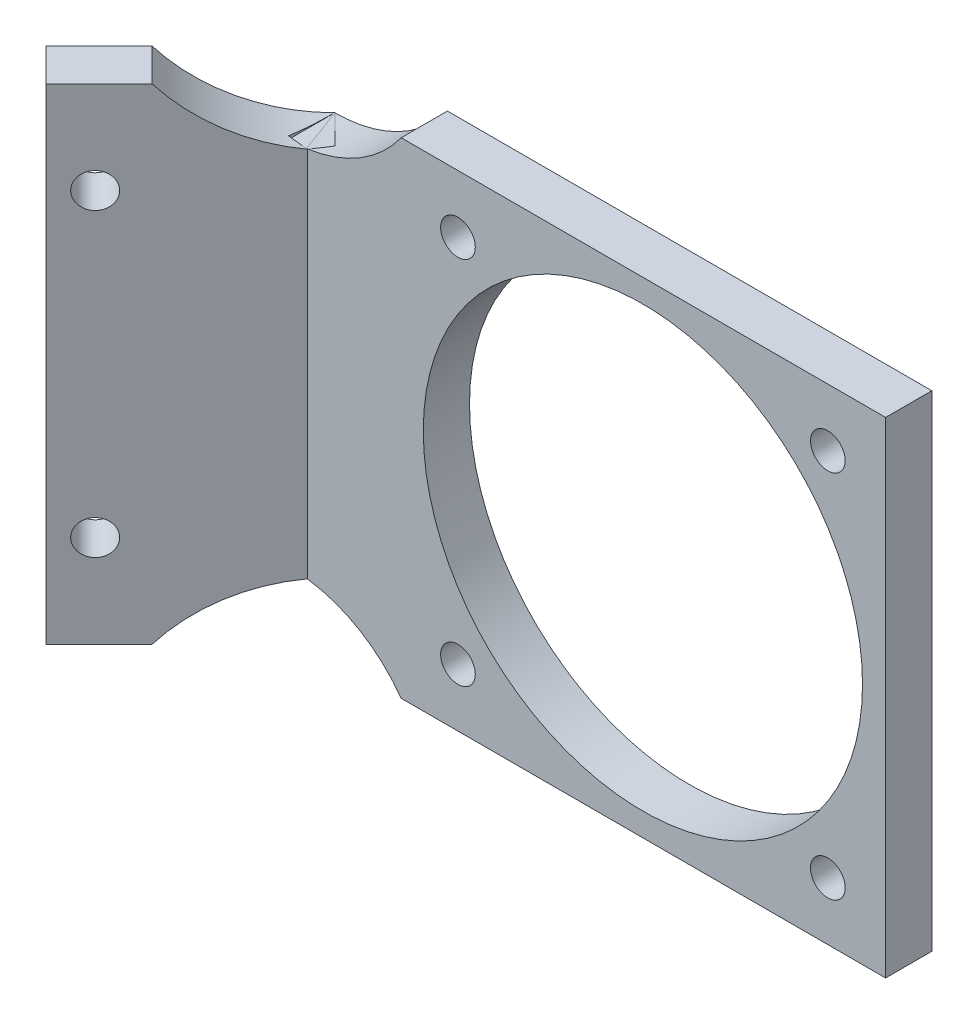
ISO-10303-21;
HEADER;
FILE_DESCRIPTION(('STEP AP214'),'2;1');
FILE_NAME('part.step','',(''),(''),'','','');
FILE_SCHEMA(('AUTOMOTIVE_DESIGN { 1 0 10303 214 1 1 1 1 }'));
ENDSEC;
DATA;
#1=APPLICATION_CONTEXT('core data for automotive mechanical design processes');
#2=APPLICATION_PROTOCOL_DEFINITION('international standard','automotive_design',2000,#1);
#3=PRODUCT_CONTEXT('',#1,'mechanical');
#4=PRODUCT('Part','Part','',(#3));
#5=PRODUCT_RELATED_PRODUCT_CATEGORY('part','',(#4));
#6=PRODUCT_DEFINITION_FORMATION('','',#4);
#7=PRODUCT_DEFINITION_CONTEXT('part definition',#1,'design');
#8=PRODUCT_DEFINITION('design','',#6,#7);
#9=PRODUCT_DEFINITION_SHAPE('','',#8);
#10=(LENGTH_UNIT() NAMED_UNIT(*) SI_UNIT(.MILLI.,.METRE.));
#11=(NAMED_UNIT(*) PLANE_ANGLE_UNIT() SI_UNIT($,.RADIAN.));
#12=(NAMED_UNIT(*) SI_UNIT($,.STERADIAN.) SOLID_ANGLE_UNIT());
#13=UNCERTAINTY_MEASURE_WITH_UNIT(LENGTH_MEASURE(1.E-05),#10,'distance_accuracy_value','');
#14=(GEOMETRIC_REPRESENTATION_CONTEXT(3) GLOBAL_UNCERTAINTY_ASSIGNED_CONTEXT((#13)) GLOBAL_UNIT_ASSIGNED_CONTEXT((#10,
#11,#12)) REPRESENTATION_CONTEXT('',''));
#15=CARTESIAN_POINT('',(0.,0.,0.));
#16=DIRECTION('',(0.,0.,1.));
#17=DIRECTION('',(1.,0.,0.));
#18=AXIS2_PLACEMENT_3D('',#15,#16,#17);
#19=CARTESIAN_POINT('',(0.,0.,0.));
#20=DIRECTION('',(0.,1.,0.));
#21=DIRECTION('',(0.,0.,1.));
#22=AXIS2_PLACEMENT_3D('',#19,#20,#21);
#23=PLANE('',#22);
#24=DIRECTION('',(-0.707106781186546,0.,0.707106781186549));
#25=VECTOR('',#24,1.);
#26=CARTESIAN_POINT('',(-12.4852813742386,0.,12.4852813742386));
#27=LINE('',#26,#25);
#28=CARTESIAN_POINT('',(-7.90569415042093,0.,7.90569415042097));
#29=VERTEX_POINT('',#28);
#30=CARTESIAN_POINT('',(-12.4852813742386,0.,12.4852813742386));
#31=VERTEX_POINT('',#30);
#32=EDGE_CURVE('E341',#29,#31,#27,.T.);
#33=ORIENTED_EDGE('',*,*,#32,.F.);
#34=DIRECTION('',(-0.707106781186549,0.,-0.707106781186546));
#35=VECTOR('',#34,1.);
#36=CARTESIAN_POINT('',(3.58298701216966,0.,19.3943753130115));
#37=LINE('',#36,#35);
#38=CARTESIAN_POINT('',(-5.07726702567474,0.,10.7341212751671));
#39=VERTEX_POINT('',#38);
#40=EDGE_CURVE('E343',#39,#29,#37,.T.);
#41=ORIENTED_EDGE('',*,*,#40,.F.);
#42=DIRECTION('',(0.707106781186546,0.,-0.707106781186549));
#43=VECTOR('',#42,1.);
#44=CARTESIAN_POINT('',(1.65685424949237,0.,4.00000000000001));
#45=LINE('',#44,#43);
#46=CARTESIAN_POINT('',(-9.65685424949237,0.,15.3137084989848));
#47=VERTEX_POINT('',#46);
#48=EDGE_CURVE('E350',#47,#39,#45,.T.);
#49=ORIENTED_EDGE('',*,*,#48,.F.);
#50=DIRECTION('',(0.707106781186549,0.,0.707106781186546));
#51=VECTOR('',#50,1.);
#52=CARTESIAN_POINT('',(-9.65685424949237,0.,15.3137084989848));
#53=LINE('',#52,#51);
#54=EDGE_CURVE('E345',#31,#47,#53,.T.);
#55=ORIENTED_EDGE('',*,*,#54,.F.);
#56=EDGE_LOOP('',(#33,#41,#49,#55));
#57=FACE_BOUND('',#56,.T.);
#58=ADVANCED_FACE('F35',(#57),#23,.F.);
#59=CARTESIAN_POINT('',(0.,42.,0.));
#60=DIRECTION('',(0.,1.,0.));
#61=DIRECTION('',(0.,0.,1.));
#62=AXIS2_PLACEMENT_3D('',#59,#60,#61);
#63=PLANE('',#62);
#64=DIRECTION('',(-0.707106781186549,0.,-0.707106781186546));
#65=VECTOR('',#64,1.);
#66=CARTESIAN_POINT('',(3.58298701216967,42.,19.3943753130115));
#67=LINE('',#66,#65);
#68=CARTESIAN_POINT('',(-5.07726702567474,42.,10.7341212751671));
#69=VERTEX_POINT('',#68);
#70=CARTESIAN_POINT('',(-7.90569415042093,42.,7.90569415042096));
#71=VERTEX_POINT('',#70);
#72=EDGE_CURVE('E408',#69,#71,#67,.T.);
#73=ORIENTED_EDGE('',*,*,#72,.T.);
#74=DIRECTION('',(-0.707106781186546,0.,0.707106781186549));
#75=VECTOR('',#74,1.);
#76=CARTESIAN_POINT('',(-12.4852813742386,42.,12.4852813742386));
#77=LINE('',#76,#75);
#78=CARTESIAN_POINT('',(-12.4852813742386,42.,12.4852813742386));
#79=VERTEX_POINT('',#78);
#80=EDGE_CURVE('E93',#71,#79,#77,.T.);
#81=ORIENTED_EDGE('',*,*,#80,.T.);
#82=DIRECTION('',(0.707106781186549,0.,0.707106781186546));
#83=VECTOR('',#82,1.);
#84=CARTESIAN_POINT('',(-9.65685424949237,42.,15.3137084989848));
#85=LINE('',#84,#83);
#86=CARTESIAN_POINT('',(-9.65685424949237,42.,15.3137084989848));
#87=VERTEX_POINT('',#86);
#88=EDGE_CURVE('E187',#79,#87,#85,.T.);
#89=ORIENTED_EDGE('',*,*,#88,.T.);
#90=DIRECTION('',(0.707106781186546,0.,-0.707106781186549));
#91=VECTOR('',#90,1.);
#92=CARTESIAN_POINT('',(1.65685424949237,42.,4.00000000000001));
#93=LINE('',#92,#91);
#94=EDGE_CURVE('E363',#87,#69,#93,.T.);
#95=ORIENTED_EDGE('',*,*,#94,.T.);
#96=EDGE_LOOP('',(#73,#81,#89,#95));
#97=FACE_BOUND('',#96,.T.);
#98=ADVANCED_FACE('F307',(#97),#63,.T.);
#99=CARTESIAN_POINT('',(-12.4852813742386,42.,12.4852813742386));
#100=DIRECTION('',(0.707106781186549,0.,0.707106781186546));
#101=DIRECTION('',(0.707106781186546,0.,-0.707106781186549));
#102=AXIS2_PLACEMENT_3D('',#99,#100,#101);
#103=PLANE('',#102);
#104=CARTESIAN_POINT('',(-10.3639610306789,8.,10.363961030679));
#105=DIRECTION('',(0.707106781186549,0.,0.707106781186546));
#106=DIRECTION('',(0.707106781186546,0.,-0.707106781186549));
#107=AXIS2_PLACEMENT_3D('',#104,#105,#106);
#108=CIRCLE('',#107,1.5);
#109=CARTESIAN_POINT('',(-9.3033008588991,8.,9.30330085889914));
#110=VERTEX_POINT('',#109);
#111=EDGE_CURVE('E371',#110,#110,#108,.F.);
#112=ORIENTED_EDGE('',*,*,#111,.F.);
#113=EDGE_LOOP('',(#112));
#114=FACE_BOUND('',#113,.T.);
#115=CARTESIAN_POINT('',(-10.3639610306789,34.,10.363961030679));
#116=DIRECTION('',(0.707106781186549,0.,0.707106781186546));
#117=DIRECTION('',(0.707106781186546,0.,-0.707106781186549));
#118=AXIS2_PLACEMENT_3D('',#115,#116,#117);
#119=CIRCLE('',#118,1.5);
#120=CARTESIAN_POINT('',(-9.3033008588991,34.,9.30330085889914));
#121=VERTEX_POINT('',#120);
#122=EDGE_CURVE('E348',#121,#121,#119,.F.);
#123=ORIENTED_EDGE('',*,*,#122,.F.);
#124=EDGE_LOOP('',(#123));
#125=FACE_BOUND('',#124,.T.);
#126=DIRECTION('',(0.,-1.,0.));
#127=VECTOR('',#126,1.);
#128=CARTESIAN_POINT('',(0.,42.,0.));
#129=LINE('',#128,#127);
#130=CARTESIAN_POINT('',(0.,37.,0.));
#131=VERTEX_POINT('',#130);
#132=CARTESIAN_POINT('',(0.,5.,0.));
#133=VERTEX_POINT('',#132);
#134=EDGE_CURVE('E192',#131,#133,#129,.T.);
#135=ORIENTED_EDGE('',*,*,#134,.T.);
#136=CARTESIAN_POINT('',(0.,-10.,0.));
#137=DIRECTION('',(-0.707106781186549,0.,-0.707106781186546));
#138=DIRECTION('',(0.707106781186546,0.,-0.707106781186549));
#139=AXIS2_PLACEMENT_3D('',#136,#137,#138);
#140=CIRCLE('',#139,15.);
#141=EDGE_CURVE('E220',#29,#133,#140,.T.);
#142=ORIENTED_EDGE('',*,*,#141,.F.);
#143=ORIENTED_EDGE('',*,*,#32,.T.);
#144=DIRECTION('',(0.,-1.,0.));
#145=VECTOR('',#144,1.);
#146=CARTESIAN_POINT('',(-12.4852813742386,42.,12.4852813742386));
#147=LINE('',#146,#145);
#148=EDGE_CURVE('E205',#79,#31,#147,.T.);
#149=ORIENTED_EDGE('',*,*,#148,.F.);
#150=ORIENTED_EDGE('',*,*,#80,.F.);
#151=CARTESIAN_POINT('',(0.,52.,0.));
#152=DIRECTION('',(-0.707106781186549,0.,-0.707106781186546));
#153=DIRECTION('',(-0.707106781186546,0.,0.707106781186549));
#154=AXIS2_PLACEMENT_3D('',#151,#152,#153);
#155=CIRCLE('',#154,15.);
#156=EDGE_CURVE('E411',#131,#71,#155,.T.);
#157=ORIENTED_EDGE('',*,*,#156,.F.);
#158=EDGE_LOOP('',(#135,#142,#143,#149,#150,#157));
#159=FACE_BOUND('',#158,.T.);
#160=ADVANCED_FACE('F37',(#114,#125,#159),#103,.F.);
#161=CARTESIAN_POINT('',(-9.65685424949237,42.,15.3137084989848));
#162=DIRECTION('',(0.707106781186546,0.,-0.707106781186549));
#163=DIRECTION('',(-0.707106781186549,0.,-0.707106781186546));
#164=AXIS2_PLACEMENT_3D('',#161,#162,#163);
#165=PLANE('',#164);
#166=ORIENTED_EDGE('',*,*,#54,.T.);
#167=DIRECTION('',(0.,-1.,0.));
#168=VECTOR('',#167,1.);
#169=CARTESIAN_POINT('',(-9.65685424949237,42.,15.3137084989848));
#170=LINE('',#169,#168);
#171=EDGE_CURVE('E202',#87,#47,#170,.T.);
#172=ORIENTED_EDGE('',*,*,#171,.F.);
#173=ORIENTED_EDGE('',*,*,#88,.F.);
#174=ORIENTED_EDGE('',*,*,#148,.T.);
#175=EDGE_LOOP('',(#166,#172,#173,#174));
#176=FACE_BOUND('',#175,.T.);
#177=ADVANCED_FACE('F322',(#176),#165,.F.);
#178=CARTESIAN_POINT('',(1.65685424949237,42.,4.00000000000001));
#179=DIRECTION('',(-0.707106781186549,0.,-0.707106781186546));
#180=DIRECTION('',(-0.707106781186546,0.,0.707106781186549));
#181=AXIS2_PLACEMENT_3D('',#178,#179,#180);
#182=PLANE('',#181);
#183=CARTESIAN_POINT('',(-7.53553390593273,8.,13.1923881554251));
#184=DIRECTION('',(0.707106781186549,0.,0.707106781186546));
#185=DIRECTION('',(0.707106781186546,0.,-0.707106781186549));
#186=AXIS2_PLACEMENT_3D('',#183,#184,#185);
#187=CIRCLE('',#186,1.5);
#188=CARTESIAN_POINT('',(-6.47487373415291,8.,12.1317279836453));
#189=VERTEX_POINT('',#188);
#190=EDGE_CURVE('E374',#189,#189,#187,.T.);
#191=ORIENTED_EDGE('',*,*,#190,.F.);
#192=EDGE_LOOP('',(#191));
#193=FACE_BOUND('',#192,.T.);
#194=CARTESIAN_POINT('',(-7.53553390593273,34.,13.1923881554251));
#195=DIRECTION('',(0.707106781186549,0.,0.707106781186546));
#196=DIRECTION('',(0.707106781186546,0.,-0.707106781186549));
#197=AXIS2_PLACEMENT_3D('',#194,#195,#196);
#198=CIRCLE('',#197,1.5);
#199=CARTESIAN_POINT('',(-6.47487373415291,34.,12.1317279836453));
#200=VERTEX_POINT('',#199);
#201=EDGE_CURVE('E353',#200,#200,#198,.T.);
#202=ORIENTED_EDGE('',*,*,#201,.F.);
#203=EDGE_LOOP('',(#202));
#204=FACE_BOUND('',#203,.T.);
#205=ORIENTED_EDGE('',*,*,#48,.T.);
#206=CARTESIAN_POINT('',(2.82842712474619,-10.,2.82842712474618));
#207=DIRECTION('',(-0.707106781186549,0.,-0.707106781186546));
#208=DIRECTION('',(-0.707106781186546,0.,0.707106781186549));
#209=AXIS2_PLACEMENT_3D('',#206,#207,#208);
#210=CIRCLE('',#209,15.);
#211=CARTESIAN_POINT('',(1.65685424949237,4.90821364201422,4.));
#212=VERTEX_POINT('',#211);
#213=EDGE_CURVE('E426',#212,#39,#210,.F.);
#214=ORIENTED_EDGE('',*,*,#213,.F.);
#215=DIRECTION('',(0.,-1.,0.));
#216=VECTOR('',#215,1.);
#217=CARTESIAN_POINT('',(1.65685424949237,42.,4.00000000000001));
#218=LINE('',#217,#216);
#219=CARTESIAN_POINT('',(1.65685424949237,37.0917863579858,4.));
#220=VERTEX_POINT('',#219);
#221=EDGE_CURVE('E199',#220,#212,#218,.T.);
#222=ORIENTED_EDGE('',*,*,#221,.F.);
#223=CARTESIAN_POINT('',(2.82842712474619,52.,2.82842712474618));
#224=DIRECTION('',(-0.707106781186549,0.,-0.707106781186546));
#225=DIRECTION('',(-0.707106781186546,0.,0.707106781186549));
#226=AXIS2_PLACEMENT_3D('',#223,#224,#225);
#227=CIRCLE('',#226,15.);
#228=EDGE_CURVE('E407',#69,#220,#227,.F.);
#229=ORIENTED_EDGE('',*,*,#228,.F.);
#230=ORIENTED_EDGE('',*,*,#94,.F.);
#231=ORIENTED_EDGE('',*,*,#171,.T.);
#232=EDGE_LOOP('',(#205,#214,#222,#229,#230,#231));
#233=FACE_BOUND('',#232,.T.);
#234=ADVANCED_FACE('F319',(#193,#204,#233),#182,.F.);
#235=CARTESIAN_POINT('',(51.6568542494924,42.,4.));
#236=DIRECTION('',(0.,0.,-1.));
#237=DIRECTION('',(-1.,0.,0.));
#238=AXIS2_PLACEMENT_3D('',#235,#236,#237);
#239=PLANE('',#238);
#240=CARTESIAN_POINT('',(30.6568542494924,21.,4.00000000000001));
#241=DIRECTION('',(0.,0.,1.));
#242=DIRECTION('',(1.,0.,0.));
#243=AXIS2_PLACEMENT_3D('',#240,#241,#242);
#244=CIRCLE('',#243,19.);
#245=CARTESIAN_POINT('',(49.6568542494924,21.,4.00000000000001));
#246=VERTEX_POINT('',#245);
#247=EDGE_CURVE('E404',#246,#246,#244,.T.);
#248=ORIENTED_EDGE('',*,*,#247,.F.);
#249=EDGE_LOOP('',(#248));
#250=FACE_BOUND('',#249,.T.);
#251=CARTESIAN_POINT('',(14.6568542494924,5.,4.00000000000001));
#252=DIRECTION('',(0.,0.,1.));
#253=DIRECTION('',(1.,0.,0.));
#254=AXIS2_PLACEMENT_3D('',#251,#252,#253);
#255=CIRCLE('',#254,1.5);
#256=CARTESIAN_POINT('',(16.1568542494924,5.,4.00000000000001));
#257=VERTEX_POINT('',#256);
#258=EDGE_CURVE('E398',#257,#257,#255,.T.);
#259=ORIENTED_EDGE('',*,*,#258,.F.);
#260=EDGE_LOOP('',(#259));
#261=FACE_BOUND('',#260,.T.);
#262=CARTESIAN_POINT('',(46.6568542494924,5.,4.00000000000001));
#263=DIRECTION('',(0.,0.,1.));
#264=DIRECTION('',(1.,0.,0.));
#265=AXIS2_PLACEMENT_3D('',#262,#263,#264);
#266=CIRCLE('',#265,1.5);
#267=CARTESIAN_POINT('',(48.1568542494924,5.,4.00000000000001));
#268=VERTEX_POINT('',#267);
#269=EDGE_CURVE('E392',#268,#268,#266,.T.);
#270=ORIENTED_EDGE('',*,*,#269,.F.);
#271=EDGE_LOOP('',(#270));
#272=FACE_BOUND('',#271,.T.);
#273=CARTESIAN_POINT('',(46.6568542494924,37.,4.00000000000001));
#274=DIRECTION('',(0.,0.,1.));
#275=DIRECTION('',(1.,0.,0.));
#276=AXIS2_PLACEMENT_3D('',#273,#274,#275);
#277=CIRCLE('',#276,1.5);
#278=CARTESIAN_POINT('',(48.1568542494924,37.,4.00000000000001));
#279=VERTEX_POINT('',#278);
#280=EDGE_CURVE('E386',#279,#279,#277,.T.);
#281=ORIENTED_EDGE('',*,*,#280,.F.);
#282=EDGE_LOOP('',(#281));
#283=FACE_BOUND('',#282,.T.);
#284=CARTESIAN_POINT('',(14.6568542494924,37.,4.00000000000001));
#285=DIRECTION('',(0.,0.,1.));
#286=DIRECTION('',(1.,0.,0.));
#287=AXIS2_PLACEMENT_3D('',#284,#285,#286);
#288=CIRCLE('',#287,1.5);
#289=CARTESIAN_POINT('',(16.1568542494924,37.,4.00000000000001));
#290=VERTEX_POINT('',#289);
#291=EDGE_CURVE('E380',#290,#290,#288,.T.);
#292=ORIENTED_EDGE('',*,*,#291,.F.);
#293=EDGE_LOOP('',(#292));
#294=FACE_BOUND('',#293,.T.);
#295=DIRECTION('',(0.,1.,0.));
#296=VECTOR('',#295,1.);
#297=CARTESIAN_POINT('',(1.65685424949238,42.,4.00000000000001));
#298=LINE('',#297,#296);
#299=CARTESIAN_POINT('',(1.65685424949237,4.8850676900024,4.00000000000001));
#300=VERTEX_POINT('',#299);
#301=EDGE_CURVE('E416',#300,#212,#298,.T.);
#302=ORIENTED_EDGE('',*,*,#301,.F.);
#303=CARTESIAN_POINT('',(0.,-7.,4.00000000000001));
#304=DIRECTION('',(0.,0.,-1.));
#305=DIRECTION('',(-1.,0.,0.));
#306=AXIS2_PLACEMENT_3D('',#303,#304,#305);
#307=CIRCLE('',#306,12.);
#308=CARTESIAN_POINT('',(9.74679434480896,0.,4.00000000000001));
#309=VERTEX_POINT('',#308);
#310=EDGE_CURVE('E235',#309,#300,#307,.F.);
#311=ORIENTED_EDGE('',*,*,#310,.F.);
#312=DIRECTION('',(1.,0.,0.));
#313=VECTOR('',#312,1.);
#314=CARTESIAN_POINT('',(51.6568542494924,0.,4.));
#315=LINE('',#314,#313);
#316=CARTESIAN_POINT('',(51.6568542494924,0.,4.));
#317=VERTEX_POINT('',#316);
#318=EDGE_CURVE('E180',#309,#317,#315,.T.);
#319=ORIENTED_EDGE('',*,*,#318,.T.);
#320=DIRECTION('',(0.,-1.,0.));
#321=VECTOR('',#320,1.);
#322=CARTESIAN_POINT('',(51.6568542494924,42.,4.));
#323=LINE('',#322,#321);
#324=CARTESIAN_POINT('',(51.6568542494924,42.,4.));
#325=VERTEX_POINT('',#324);
#326=EDGE_CURVE('E197',#325,#317,#323,.T.);
#327=ORIENTED_EDGE('',*,*,#326,.F.);
#328=DIRECTION('',(1.,0.,0.));
#329=VECTOR('',#328,1.);
#330=CARTESIAN_POINT('',(51.6568542494924,42.,4.));
#331=LINE('',#330,#329);
#332=CARTESIAN_POINT('',(9.74679434480896,42.,4.00000000000001));
#333=VERTEX_POINT('',#332);
#334=EDGE_CURVE('E362',#333,#325,#331,.T.);
#335=ORIENTED_EDGE('',*,*,#334,.F.);
#336=CARTESIAN_POINT('',(0.,49.,4.00000000000001));
#337=DIRECTION('',(0.,0.,-1.));
#338=DIRECTION('',(-1.,0.,0.));
#339=AXIS2_PLACEMENT_3D('',#336,#337,#338);
#340=CIRCLE('',#339,12.);
#341=CARTESIAN_POINT('',(1.65685424949237,37.1149323099976,4.00000000000001));
#342=VERTEX_POINT('',#341);
#343=EDGE_CURVE('E242',#342,#333,#340,.F.);
#344=ORIENTED_EDGE('',*,*,#343,.F.);
#345=EDGE_CURVE('E200',#342,#220,#218,.T.);
#346=ORIENTED_EDGE('',*,*,#345,.T.);
#347=ORIENTED_EDGE('',*,*,#221,.T.);
#348=EDGE_LOOP('',(#302,#311,#319,#327,#335,#344,#346,#347));
#349=FACE_BOUND('',#348,.T.);
#350=ADVANCED_FACE('F316',(#250,#261,#272,#283,#294,#349),#239,.F.);
#351=CARTESIAN_POINT('',(51.6568542494924,42.,0.));
#352=DIRECTION('',(-1.,0.,0.));
#353=DIRECTION('',(0.,0.,1.));
#354=AXIS2_PLACEMENT_3D('',#351,#352,#353);
#355=PLANE('',#354);
#356=DIRECTION('',(0.,0.,-1.));
#357=VECTOR('',#356,1.);
#358=CARTESIAN_POINT('',(51.6568542494924,0.,0.));
#359=LINE('',#358,#357);
#360=CARTESIAN_POINT('',(51.6568542494924,0.,0.));
#361=VERTEX_POINT('',#360);
#362=EDGE_CURVE('E85',#317,#361,#359,.T.);
#363=ORIENTED_EDGE('',*,*,#362,.T.);
#364=DIRECTION('',(0.,-1.,0.));
#365=VECTOR('',#364,1.);
#366=CARTESIAN_POINT('',(51.6568542494924,42.,0.));
#367=LINE('',#366,#365);
#368=CARTESIAN_POINT('',(51.6568542494924,42.,0.));
#369=VERTEX_POINT('',#368);
#370=EDGE_CURVE('E185',#369,#361,#367,.T.);
#371=ORIENTED_EDGE('',*,*,#370,.F.);
#372=DIRECTION('',(0.,0.,-1.));
#373=VECTOR('',#372,1.);
#374=CARTESIAN_POINT('',(51.6568542494924,42.,0.));
#375=LINE('',#374,#373);
#376=EDGE_CURVE('E64',#325,#369,#375,.T.);
#377=ORIENTED_EDGE('',*,*,#376,.F.);
#378=ORIENTED_EDGE('',*,*,#326,.T.);
#379=EDGE_LOOP('',(#363,#371,#377,#378));
#380=FACE_BOUND('',#379,.T.);
#381=ADVANCED_FACE('F312',(#380),#355,.F.);
#382=CARTESIAN_POINT('',(0.,42.,0.));
#383=DIRECTION('',(0.,0.,1.));
#384=DIRECTION('',(1.,0.,0.));
#385=AXIS2_PLACEMENT_3D('',#382,#383,#384);
#386=PLANE('',#385);
#387=CARTESIAN_POINT('',(30.6568542494924,21.,0.));
#388=DIRECTION('',(0.,0.,1.));
#389=DIRECTION('',(1.,0.,0.));
#390=AXIS2_PLACEMENT_3D('',#387,#388,#389);
#391=CIRCLE('',#390,19.);
#392=CARTESIAN_POINT('',(49.6568542494924,21.,0.));
#393=VERTEX_POINT('',#392);
#394=EDGE_CURVE('E401',#393,#393,#391,.F.);
#395=ORIENTED_EDGE('',*,*,#394,.F.);
#396=EDGE_LOOP('',(#395));
#397=FACE_BOUND('',#396,.T.);
#398=CARTESIAN_POINT('',(14.6568542494924,5.,0.));
#399=DIRECTION('',(0.,0.,1.));
#400=DIRECTION('',(1.,0.,0.));
#401=AXIS2_PLACEMENT_3D('',#398,#399,#400);
#402=CIRCLE('',#401,1.5);
#403=CARTESIAN_POINT('',(16.1568542494924,5.,0.));
#404=VERTEX_POINT('',#403);
#405=EDGE_CURVE('E395',#404,#404,#402,.F.);
#406=ORIENTED_EDGE('',*,*,#405,.F.);
#407=EDGE_LOOP('',(#406));
#408=FACE_BOUND('',#407,.T.);
#409=CARTESIAN_POINT('',(46.6568542494924,5.,0.));
#410=DIRECTION('',(0.,0.,1.));
#411=DIRECTION('',(1.,0.,0.));
#412=AXIS2_PLACEMENT_3D('',#409,#410,#411);
#413=CIRCLE('',#412,1.5);
#414=CARTESIAN_POINT('',(48.1568542494924,5.,0.));
#415=VERTEX_POINT('',#414);
#416=EDGE_CURVE('E389',#415,#415,#413,.F.);
#417=ORIENTED_EDGE('',*,*,#416,.F.);
#418=EDGE_LOOP('',(#417));
#419=FACE_BOUND('',#418,.T.);
#420=CARTESIAN_POINT('',(46.6568542494924,37.,0.));
#421=DIRECTION('',(0.,0.,1.));
#422=DIRECTION('',(1.,0.,0.));
#423=AXIS2_PLACEMENT_3D('',#420,#421,#422);
#424=CIRCLE('',#423,1.5);
#425=CARTESIAN_POINT('',(48.1568542494924,37.,0.));
#426=VERTEX_POINT('',#425);
#427=EDGE_CURVE('E383',#426,#426,#424,.F.);
#428=ORIENTED_EDGE('',*,*,#427,.F.);
#429=EDGE_LOOP('',(#428));
#430=FACE_BOUND('',#429,.T.);
#431=CARTESIAN_POINT('',(14.6568542494924,37.,0.));
#432=DIRECTION('',(0.,0.,1.));
#433=DIRECTION('',(1.,0.,0.));
#434=AXIS2_PLACEMENT_3D('',#431,#432,#433);
#435=CIRCLE('',#434,1.5);
#436=CARTESIAN_POINT('',(16.1568542494924,37.,0.));
#437=VERTEX_POINT('',#436);
#438=EDGE_CURVE('E377',#437,#437,#435,.F.);
#439=ORIENTED_EDGE('',*,*,#438,.F.);
#440=EDGE_LOOP('',(#439));
#441=FACE_BOUND('',#440,.T.);
#442=DIRECTION('',(-1.,0.,0.));
#443=VECTOR('',#442,1.);
#444=CARTESIAN_POINT('',(0.,0.,0.));
#445=LINE('',#444,#443);
#446=CARTESIAN_POINT('',(9.74679434480896,0.,0.));
#447=VERTEX_POINT('',#446);
#448=EDGE_CURVE('E179',#361,#447,#445,.T.);
#449=ORIENTED_EDGE('',*,*,#448,.T.);
#450=CARTESIAN_POINT('',(0.,-7.,0.));
#451=DIRECTION('',(0.,0.,-1.));
#452=DIRECTION('',(-1.,0.,0.));
#453=AXIS2_PLACEMENT_3D('',#450,#451,#452);
#454=CIRCLE('',#453,12.);
#455=EDGE_CURVE('E163',#133,#447,#454,.T.);
#456=ORIENTED_EDGE('',*,*,#455,.F.);
#457=ORIENTED_EDGE('',*,*,#134,.F.);
#458=CARTESIAN_POINT('',(0.,49.,0.));
#459=DIRECTION('',(0.,0.,-1.));
#460=DIRECTION('',(1.,0.,0.));
#461=AXIS2_PLACEMENT_3D('',#458,#459,#460);
#462=CIRCLE('',#461,12.);
#463=CARTESIAN_POINT('',(9.74679434480896,42.,0.));
#464=VERTEX_POINT('',#463);
#465=EDGE_CURVE('E237',#464,#131,#462,.T.);
#466=ORIENTED_EDGE('',*,*,#465,.F.);
#467=DIRECTION('',(-1.,0.,0.));
#468=VECTOR('',#467,1.);
#469=CARTESIAN_POINT('',(0.,42.,0.));
#470=LINE('',#469,#468);
#471=EDGE_CURVE('E195',#369,#464,#470,.T.);
#472=ORIENTED_EDGE('',*,*,#471,.F.);
#473=ORIENTED_EDGE('',*,*,#370,.T.);
#474=EDGE_LOOP('',(#449,#456,#457,#466,#472,#473));
#475=FACE_BOUND('',#474,.T.);
#476=ADVANCED_FACE('F183',(#397,#408,#419,#430,#441,#475),#386,.F.);
#477=DIRECTION('',(0.,0.,-1.));
#478=VECTOR('',#477,1.);
#479=CARTESIAN_POINT('',(9.74679434480896,42.,14.9544511501033));
#480=LINE('',#479,#478);
#481=EDGE_CURVE('E246',#333,#464,#480,.T.);
#482=ORIENTED_EDGE('',*,*,#481,.F.);
#483=ORIENTED_EDGE('',*,*,#334,.T.);
#484=ORIENTED_EDGE('',*,*,#376,.T.);
#485=ORIENTED_EDGE('',*,*,#471,.T.);
#486=EDGE_LOOP('',(#482,#483,#484,#485));
#487=FACE_BOUND('',#486,.T.);
#488=ADVANCED_FACE('F304',(#487),#63,.T.);
#489=ORIENTED_EDGE('',*,*,#318,.F.);
#490=DIRECTION('',(0.,0.,-1.));
#491=VECTOR('',#490,1.);
#492=CARTESIAN_POINT('',(9.74679434480896,0.,14.9544511501033));
#493=LINE('',#492,#491);
#494=EDGE_CURVE('E166',#309,#447,#493,.T.);
#495=ORIENTED_EDGE('',*,*,#494,.T.);
#496=ORIENTED_EDGE('',*,*,#448,.F.);
#497=ORIENTED_EDGE('',*,*,#362,.F.);
#498=EDGE_LOOP('',(#489,#495,#496,#497));
#499=FACE_BOUND('',#498,.T.);
#500=ADVANCED_FACE('F178',(#499),#23,.F.);
#501=CARTESIAN_POINT('',(-16.6076017177982,34.,4.12032034355968));
#502=DIRECTION('',(0.707106781186549,0.,0.707106781186546));
#503=DIRECTION('',(0.707106781186546,0.,-0.707106781186549));
#504=AXIS2_PLACEMENT_3D('',#501,#502,#503);
#505=CYLINDRICAL_SURFACE('',#504,1.5);
#506=ORIENTED_EDGE('',*,*,#201,.T.);
#507=EDGE_LOOP('',(#506));
#508=FACE_BOUND('',#507,.T.);
#509=ORIENTED_EDGE('',*,*,#122,.T.);
#510=EDGE_LOOP('',(#509));
#511=FACE_BOUND('',#510,.T.);
#512=ADVANCED_FACE('F299',(#508,#511),#505,.F.);
#513=CARTESIAN_POINT('',(-16.6076017177982,8.,4.12032034355968));
#514=DIRECTION('',(0.707106781186549,0.,0.707106781186546));
#515=DIRECTION('',(0.707106781186546,0.,-0.707106781186549));
#516=AXIS2_PLACEMENT_3D('',#513,#514,#515);
#517=CYLINDRICAL_SURFACE('',#516,1.5);
#518=ORIENTED_EDGE('',*,*,#190,.T.);
#519=EDGE_LOOP('',(#518));
#520=FACE_BOUND('',#519,.T.);
#521=ORIENTED_EDGE('',*,*,#111,.T.);
#522=EDGE_LOOP('',(#521));
#523=FACE_BOUND('',#522,.T.);
#524=ADVANCED_FACE('F295',(#520,#523),#517,.F.);
#525=CARTESIAN_POINT('',(14.6568542494924,37.,-0.00100000000000013));
#526=DIRECTION('',(0.,0.,1.));
#527=DIRECTION('',(1.,0.,0.));
#528=AXIS2_PLACEMENT_3D('',#525,#526,#527);
#529=CYLINDRICAL_SURFACE('',#528,1.5);
#530=ORIENTED_EDGE('',*,*,#291,.T.);
#531=EDGE_LOOP('',(#530));
#532=FACE_BOUND('',#531,.T.);
#533=ORIENTED_EDGE('',*,*,#438,.T.);
#534=EDGE_LOOP('',(#533));
#535=FACE_BOUND('',#534,.T.);
#536=ADVANCED_FACE('F291',(#532,#535),#529,.F.);
#537=CARTESIAN_POINT('',(46.6568542494924,37.,-0.00100000000000013));
#538=DIRECTION('',(0.,0.,1.));
#539=DIRECTION('',(1.,0.,0.));
#540=AXIS2_PLACEMENT_3D('',#537,#538,#539);
#541=CYLINDRICAL_SURFACE('',#540,1.5);
#542=ORIENTED_EDGE('',*,*,#280,.T.);
#543=EDGE_LOOP('',(#542));
#544=FACE_BOUND('',#543,.T.);
#545=ORIENTED_EDGE('',*,*,#427,.T.);
#546=EDGE_LOOP('',(#545));
#547=FACE_BOUND('',#546,.T.);
#548=ADVANCED_FACE('F287',(#544,#547),#541,.F.);
#549=CARTESIAN_POINT('',(46.6568542494924,5.,-0.00100000000000013));
#550=DIRECTION('',(0.,0.,1.));
#551=DIRECTION('',(1.,0.,0.));
#552=AXIS2_PLACEMENT_3D('',#549,#550,#551);
#553=CYLINDRICAL_SURFACE('',#552,1.5);
#554=ORIENTED_EDGE('',*,*,#269,.T.);
#555=EDGE_LOOP('',(#554));
#556=FACE_BOUND('',#555,.T.);
#557=ORIENTED_EDGE('',*,*,#416,.T.);
#558=EDGE_LOOP('',(#557));
#559=FACE_BOUND('',#558,.T.);
#560=ADVANCED_FACE('F283',(#556,#559),#553,.F.);
#561=CARTESIAN_POINT('',(14.6568542494924,5.,-0.00100000000000013));
#562=DIRECTION('',(0.,0.,1.));
#563=DIRECTION('',(1.,0.,0.));
#564=AXIS2_PLACEMENT_3D('',#561,#562,#563);
#565=CYLINDRICAL_SURFACE('',#564,1.5);
#566=ORIENTED_EDGE('',*,*,#258,.T.);
#567=EDGE_LOOP('',(#566));
#568=FACE_BOUND('',#567,.T.);
#569=ORIENTED_EDGE('',*,*,#405,.T.);
#570=EDGE_LOOP('',(#569));
#571=FACE_BOUND('',#570,.T.);
#572=ADVANCED_FACE('F279',(#568,#571),#565,.F.);
#573=CARTESIAN_POINT('',(30.6568542494924,21.,-0.00100000000000013));
#574=DIRECTION('',(0.,0.,1.));
#575=DIRECTION('',(1.,0.,0.));
#576=AXIS2_PLACEMENT_3D('',#573,#574,#575);
#577=CYLINDRICAL_SURFACE('',#576,19.);
#578=ORIENTED_EDGE('',*,*,#247,.T.);
#579=EDGE_LOOP('',(#578));
#580=FACE_BOUND('',#579,.T.);
#581=ORIENTED_EDGE('',*,*,#394,.T.);
#582=EDGE_LOOP('',(#581));
#583=FACE_BOUND('',#582,.T.);
#584=ADVANCED_FACE('F276',(#580,#583),#577,.F.);
#585=CARTESIAN_POINT('',(1.65685424949237,42.,4.00000000000001));
#586=DIRECTION('',(-0.707106781186549,0.,-0.707106781186546));
#587=DIRECTION('',(-0.707106781186546,0.,0.707106781186549));
#588=AXIS2_PLACEMENT_3D('',#585,#586,#587);
#589=PLANE('',#588);
#590=CARTESIAN_POINT('',(0.,49.,5.65685424949238));
#591=DIRECTION('',(-0.707106781186549,0.,-0.707106781186546));
#592=DIRECTION('',(0.707106781186546,0.,-0.707106781186549));
#593=AXIS2_PLACEMENT_3D('',#590,#591,#592);
#594=ELLIPSE('',#593,16.9705627484772,12.);
#595=CARTESIAN_POINT('',(2.82842712474619,37.3380962103094,2.82842712474618));
#596=VERTEX_POINT('',#595);
#597=EDGE_CURVE('E261',#596,#342,#594,.T.);
#598=ORIENTED_EDGE('',*,*,#597,.F.);
#599=DIRECTION('',(0.,1.,0.));
#600=VECTOR('',#599,1.);
#601=CARTESIAN_POINT('',(2.82842712474619,37.,2.82842712474618));
#602=LINE('',#601,#600);
#603=CARTESIAN_POINT('',(2.82842712474619,37.,2.82842712474618));
#604=VERTEX_POINT('',#603);
#605=EDGE_CURVE('E414',#604,#596,#602,.T.);
#606=ORIENTED_EDGE('',*,*,#605,.F.);
#607=EDGE_CURVE('E419',#220,#604,#227,.F.);
#608=ORIENTED_EDGE('',*,*,#607,.F.);
#609=ORIENTED_EDGE('',*,*,#345,.F.);
#610=EDGE_LOOP('',(#598,#606,#608,#609));
#611=FACE_BOUND('',#610,.T.);
#612=ADVANCED_FACE('F273',(#611),#589,.T.);
#613=CARTESIAN_POINT('',(11.4886811625906,52.,11.4886811625906));
#614=DIRECTION('',(-0.707106781186549,0.,-0.707106781186546));
#615=DIRECTION('',(-0.707106781186546,0.,0.707106781186549));
#616=AXIS2_PLACEMENT_3D('',#613,#614,#615);
#617=CYLINDRICAL_SURFACE('',#616,15.);
#618=DIRECTION('',(-0.707106781186549,0.,-0.707106781186546));
#619=VECTOR('',#618,1.);
#620=CARTESIAN_POINT('',(11.4886811625906,37.,11.4886811625906));
#621=LINE('',#620,#619);
#622=EDGE_CURVE('E410',#604,#131,#621,.T.);
#623=ORIENTED_EDGE('',*,*,#622,.T.);
#624=CARTESIAN_POINT('',(1.54930479935737,37.1004346869859,4.00000000000001));
#625=CARTESIAN_POINT('',(1.29315478448609,37.0671089450518,3.33832931290702));
#626=CARTESIAN_POINT('',(1.03677030403524,37.0421142408048,2.67630807844029));
#627=CARTESIAN_POINT('',(0.523843955149945,37.0086794452987,1.35211536408065));
#628=CARTESIAN_POINT('',(0.267302148502843,37.0002348525065,0.689943974049751));
#629=CARTESIAN_POINT('',(0.0071784031056361,37.0000016126325,0.0185284550735153));
#630=CARTESIAN_POINT('',(0.00358920067633918,37.0000000023866,0.00926422531537458));
#631=CARTESIAN_POINT('',(0.,37.,0.));
#632=B_SPLINE_CURVE_WITH_KNOTS('',3,(#624,#625,#626,#627,#628,#629,#630,#631),.UNSPECIFIED.,.F.,
.F.,(4,2,2,4),(0.,2.13090471435892,4.26122975465263,4.29103537378442),.UNSPECIFIED.);
#633=CARTESIAN_POINT('',(1.54930479935763,37.1004346869859,4.00000000000001));
#634=VERTEX_POINT('',#633);
#635=EDGE_CURVE('E253',#131,#634,#632,.F.);
#636=ORIENTED_EDGE('',*,*,#635,.T.);
#637=CARTESIAN_POINT('',(4.00000000000002,52.,4.00000000000001));
#638=DIRECTION('',(0.,0.,-1.));
#639=DIRECTION('',(-1.,0.,0.));
#640=AXIS2_PLACEMENT_3D('',#637,#638,#639);
#641=ELLIPSE('',#640,21.2132034355965,15.);
#642=CARTESIAN_POINT('',(0.,37.2690801373438,4.00000000000001));
#643=VERTEX_POINT('',#642);
#644=EDGE_CURVE('E211',#643,#634,#641,.F.);
#645=ORIENTED_EDGE('',*,*,#644,.F.);
#646=CARTESIAN_POINT('',(0.,52.,0.));
#647=DIRECTION('',(-1.,0.,0.));
#648=DIRECTION('',(0.,0.,-1.));
#649=AXIS2_PLACEMENT_3D('',#646,#647,#648);
#650=ELLIPSE('',#649,21.2132034355964,15.);
#651=EDGE_CURVE('E250',#643,#131,#650,.F.);
#652=ORIENTED_EDGE('',*,*,#651,.T.);
#653=ORIENTED_EDGE('',*,*,#156,.T.);
#654=ORIENTED_EDGE('',*,*,#72,.F.);
#655=ORIENTED_EDGE('',*,*,#228,.T.);
#656=ORIENTED_EDGE('',*,*,#607,.T.);
#657=EDGE_LOOP('',(#623,#636,#645,#652,#653,#654,#655,#656));
#658=FACE_BOUND('',#657,.T.);
#659=ADVANCED_FACE('F267',(#658),#617,.F.);
#660=CARTESIAN_POINT('',(11.4886811625906,37.,11.4886811625906));
#661=DIRECTION('',(0.707106781186546,0.,-0.707106781186549));
#662=DIRECTION('',(-0.707106781186549,0.,-0.707106781186546));
#663=AXIS2_PLACEMENT_3D('',#660,#661,#662);
#664=PLANE('',#663);
#665=ORIENTED_EDGE('',*,*,#605,.T.);
#666=CARTESIAN_POINT('',(0.,49.,0.));
#667=DIRECTION('',(0.707106781186546,0.,-0.707106781186549));
#668=DIRECTION('',(-0.707106781186549,0.,-0.707106781186546));
#669=AXIS2_PLACEMENT_3D('',#666,#667,#668);
#670=ELLIPSE('',#669,16.9705627484771,12.);
#671=EDGE_CURVE('E208',#596,#131,#670,.T.);
#672=ORIENTED_EDGE('',*,*,#671,.T.);
#673=ORIENTED_EDGE('',*,*,#622,.F.);
#674=EDGE_LOOP('',(#665,#672,#673));
#675=FACE_BOUND('',#674,.T.);
#676=ADVANCED_FACE('F272',(#675),#664,.F.);
#677=CARTESIAN_POINT('',(1.65685424949237,42.,4.00000000000001));
#678=DIRECTION('',(-0.707106781186549,0.,-0.707106781186546));
#679=DIRECTION('',(-0.707106781186546,0.,0.707106781186549));
#680=AXIS2_PLACEMENT_3D('',#677,#678,#679);
#681=PLANE('',#680);
#682=CARTESIAN_POINT('',(0.,-7.,5.65685424949238));
#683=DIRECTION('',(-0.707106781186549,0.,-0.707106781186546));
#684=DIRECTION('',(0.707106781186546,0.,-0.707106781186549));
#685=AXIS2_PLACEMENT_3D('',#682,#683,#684);
#686=ELLIPSE('',#685,16.9705627484772,12.);
#687=CARTESIAN_POINT('',(2.82842712474619,4.6619037896906,2.82842712474618));
#688=VERTEX_POINT('',#687);
#689=EDGE_CURVE('E234',#300,#688,#686,.T.);
#690=ORIENTED_EDGE('',*,*,#689,.F.);
#691=ORIENTED_EDGE('',*,*,#301,.T.);
#692=CARTESIAN_POINT('',(2.82842712474619,5.,2.82842712474618));
#693=VERTEX_POINT('',#692);
#694=EDGE_CURVE('E423',#693,#212,#210,.F.);
#695=ORIENTED_EDGE('',*,*,#694,.F.);
#696=DIRECTION('',(0.,1.,0.));
#697=VECTOR('',#696,1.);
#698=CARTESIAN_POINT('',(2.82842712474619,5.,2.82842712474618));
#699=LINE('',#698,#697);
#700=EDGE_CURVE('E431',#688,#693,#699,.T.);
#701=ORIENTED_EDGE('',*,*,#700,.F.);
#702=EDGE_LOOP('',(#690,#691,#695,#701));
#703=FACE_BOUND('',#702,.T.);
#704=ADVANCED_FACE('F467',(#703),#681,.T.);
#705=CARTESIAN_POINT('',(11.4886811625906,5.,11.4886811625906));
#706=DIRECTION('',(0.707106781186546,0.,-0.707106781186549));
#707=DIRECTION('',(-0.707106781186549,0.,-0.707106781186546));
#708=AXIS2_PLACEMENT_3D('',#705,#706,#707);
#709=PLANE('',#708);
#710=DIRECTION('',(-0.707106781186549,0.,-0.707106781186546));
#711=VECTOR('',#710,1.);
#712=CARTESIAN_POINT('',(11.4886811625906,5.,11.4886811625906));
#713=LINE('',#712,#711);
#714=EDGE_CURVE('E428',#693,#133,#713,.T.);
#715=ORIENTED_EDGE('',*,*,#714,.T.);
#716=CARTESIAN_POINT('',(0.,-7.,0.));
#717=DIRECTION('',(0.707106781186546,0.,-0.707106781186549));
#718=DIRECTION('',(-0.707106781186549,0.,-0.707106781186546));
#719=AXIS2_PLACEMENT_3D('',#716,#717,#718);
#720=ELLIPSE('',#719,16.9705627484771,12.);
#721=EDGE_CURVE('E169',#133,#688,#720,.T.);
#722=ORIENTED_EDGE('',*,*,#721,.T.);
#723=ORIENTED_EDGE('',*,*,#700,.T.);
#724=EDGE_LOOP('',(#715,#722,#723));
#725=FACE_BOUND('',#724,.T.);
#726=ADVANCED_FACE('F471',(#725),#709,.F.);
#727=CARTESIAN_POINT('',(11.4886811625906,-10.,11.4886811625906));
#728=DIRECTION('',(-0.707106781186549,0.,-0.707106781186546));
#729=DIRECTION('',(-0.707106781186546,0.,0.707106781186549));
#730=AXIS2_PLACEMENT_3D('',#727,#728,#729);
#731=CYLINDRICAL_SURFACE('',#730,15.);
#732=CARTESIAN_POINT('',(4.00000000000002,-10.,4.00000000000001));
#733=DIRECTION('',(0.,0.,-1.));
#734=DIRECTION('',(-1.,0.,0.));
#735=AXIS2_PLACEMENT_3D('',#732,#733,#734);
#736=ELLIPSE('',#735,21.2132034355965,15.);
#737=CARTESIAN_POINT('',(1.54930479935762,4.89956531301412,4.00000000000001));
#738=VERTEX_POINT('',#737);
#739=CARTESIAN_POINT('',(0.,4.73091986265623,4.00000000000001));
#740=VERTEX_POINT('',#739);
#741=EDGE_CURVE('E213',#738,#740,#736,.F.);
#742=ORIENTED_EDGE('',*,*,#741,.F.);
#743=CARTESIAN_POINT('',(1.54930479935675,4.89956531301417,4.00000000000001));
#744=CARTESIAN_POINT('',(1.29315478453681,4.93289105494831,3.33832931288717));
#745=CARTESIAN_POINT('',(1.0367703040608,4.95788575919527,2.67630807843023));
#746=CARTESIAN_POINT('',(0.523843955124296,4.99132055470124,1.3521153640905));
#747=CARTESIAN_POINT('',(0.267302148451164,4.99976514749347,0.689943974069733));
#748=CARTESIAN_POINT('',(0.0071784031042052,4.99999838736754,0.0185284550740697));
#749=CARTESIAN_POINT('',(0.00358920067561622,4.99999999761344,0.00926422531565468));
#750=CARTESIAN_POINT('',(0.,5.,0.));
#751=B_SPLINE_CURVE_WITH_KNOTS('',3,(#743,#744,#745,#746,#747,#748,#749,#750),.UNSPECIFIED.,.F.,
.F.,(4,2,2,4),(0.,2.1309047143588,4.2612297546524,4.29103537378419),.UNSPECIFIED.);
#752=EDGE_CURVE('E11',#738,#133,#751,.T.);
#753=ORIENTED_EDGE('',*,*,#752,.T.);
#754=ORIENTED_EDGE('',*,*,#714,.F.);
#755=ORIENTED_EDGE('',*,*,#694,.T.);
#756=ORIENTED_EDGE('',*,*,#213,.T.);
#757=ORIENTED_EDGE('',*,*,#40,.T.);
#758=ORIENTED_EDGE('',*,*,#141,.T.);
#759=CARTESIAN_POINT('',(0.,-10.,0.));
#760=DIRECTION('',(-1.,0.,0.));
#761=DIRECTION('',(0.,0.,-1.));
#762=AXIS2_PLACEMENT_3D('',#759,#760,#761);
#763=ELLIPSE('',#762,21.2132034355964,15.);
#764=EDGE_CURVE('E48',#133,#740,#763,.F.);
#765=ORIENTED_EDGE('',*,*,#764,.T.);
#766=EDGE_LOOP('',(#742,#753,#754,#755,#756,#757,#758,#765));
#767=FACE_BOUND('',#766,.T.);
#768=ADVANCED_FACE('F218',(#767),#731,.F.);
#769=CARTESIAN_POINT('',(0.,49.,14.9544511501033));
#770=DIRECTION('',(0.,0.,-1.));
#771=DIRECTION('',(-1.,0.,0.));
#772=AXIS2_PLACEMENT_3D('',#769,#770,#771);
#773=CYLINDRICAL_SURFACE('',#772,12.);
#774=ORIENTED_EDGE('',*,*,#597,.T.);
#775=ORIENTED_EDGE('',*,*,#343,.T.);
#776=ORIENTED_EDGE('',*,*,#481,.T.);
#777=ORIENTED_EDGE('',*,*,#465,.T.);
#778=ORIENTED_EDGE('',*,*,#671,.F.);
#779=EDGE_LOOP('',(#774,#775,#776,#777,#778));
#780=FACE_BOUND('',#779,.T.);
#781=ADVANCED_FACE('F263',(#780),#773,.F.);
#782=CARTESIAN_POINT('',(51.6568542494924,42.,4.));
#783=DIRECTION('',(0.,0.,-1.));
#784=DIRECTION('',(-1.,0.,0.));
#785=AXIS2_PLACEMENT_3D('',#782,#783,#784);
#786=PLANE('',#785);
#787=ORIENTED_EDGE('',*,*,#644,.T.);
#788=CARTESIAN_POINT('',(0.,37.,4.00000000000001));
#789=VERTEX_POINT('',#788);
#790=EDGE_CURVE('E238',#789,#634,#340,.F.);
#791=ORIENTED_EDGE('',*,*,#790,.F.);
#792=DIRECTION('',(0.,-1.,0.));
#793=VECTOR('',#792,1.);
#794=CARTESIAN_POINT('',(0.,42.,4.00000000000001));
#795=LINE('',#794,#793);
#796=EDGE_CURVE('E241',#643,#789,#795,.T.);
#797=ORIENTED_EDGE('',*,*,#796,.F.);
#798=EDGE_LOOP('',(#787,#791,#797));
#799=FACE_BOUND('',#798,.T.);
#800=ADVANCED_FACE('F459',(#799),#786,.T.);
#801=DIRECTION('',(0.,0.,-1.));
#802=VECTOR('',#801,1.);
#803=CARTESIAN_POINT('',(0.,37.,14.9544511501033));
#804=LINE('',#803,#802);
#805=EDGE_CURVE('E245',#789,#131,#804,.T.);
#806=ORIENTED_EDGE('',*,*,#805,.F.);
#807=ORIENTED_EDGE('',*,*,#790,.T.);
#808=ORIENTED_EDGE('',*,*,#635,.F.);
#809=EDGE_LOOP('',(#806,#807,#808));
#810=FACE_BOUND('',#809,.T.);
#811=ADVANCED_FACE('F461',(#810),#773,.F.);
#812=CARTESIAN_POINT('',(0.,42.,14.9544511501033));
#813=DIRECTION('',(-1.,0.,0.));
#814=DIRECTION('',(0.,-1.,0.));
#815=AXIS2_PLACEMENT_3D('',#812,#813,#814);
#816=PLANE('',#815);
#817=ORIENTED_EDGE('',*,*,#796,.T.);
#818=ORIENTED_EDGE('',*,*,#805,.T.);
#819=ORIENTED_EDGE('',*,*,#651,.F.);
#820=EDGE_LOOP('',(#817,#818,#819));
#821=FACE_BOUND('',#820,.T.);
#822=ADVANCED_FACE('F454',(#821),#816,.F.);
#823=CARTESIAN_POINT('',(51.6568542494924,42.,4.));
#824=DIRECTION('',(0.,0.,-1.));
#825=DIRECTION('',(-1.,0.,0.));
#826=AXIS2_PLACEMENT_3D('',#823,#824,#825);
#827=PLANE('',#826);
#828=ORIENTED_EDGE('',*,*,#741,.T.);
#829=DIRECTION('',(0.,-1.,0.));
#830=VECTOR('',#829,1.);
#831=CARTESIAN_POINT('',(0.,0.,4.00000000000001));
#832=LINE('',#831,#830);
#833=CARTESIAN_POINT('',(0.,5.,4.00000000000001));
#834=VERTEX_POINT('',#833);
#835=EDGE_CURVE('E226',#834,#740,#832,.T.);
#836=ORIENTED_EDGE('',*,*,#835,.F.);
#837=EDGE_CURVE('E55',#738,#834,#307,.F.);
#838=ORIENTED_EDGE('',*,*,#837,.F.);
#839=EDGE_LOOP('',(#828,#836,#838));
#840=FACE_BOUND('',#839,.T.);
#841=ADVANCED_FACE('F541',(#840),#827,.T.);
#842=CARTESIAN_POINT('',(0.,0.,14.9544511501033));
#843=DIRECTION('',(-1.,0.,0.));
#844=DIRECTION('',(0.,0.,1.));
#845=AXIS2_PLACEMENT_3D('',#842,#843,#844);
#846=PLANE('',#845);
#847=DIRECTION('',(0.,0.,-1.));
#848=VECTOR('',#847,1.);
#849=CARTESIAN_POINT('',(0.,5.,14.9544511501033));
#850=LINE('',#849,#848);
#851=EDGE_CURVE('E181',#834,#133,#850,.T.);
#852=ORIENTED_EDGE('',*,*,#851,.F.);
#853=ORIENTED_EDGE('',*,*,#835,.T.);
#854=ORIENTED_EDGE('',*,*,#764,.F.);
#855=EDGE_LOOP('',(#852,#853,#854));
#856=FACE_BOUND('',#855,.T.);
#857=ADVANCED_FACE('F225',(#856),#846,.F.);
#858=CARTESIAN_POINT('',(0.,-7.,14.9544511501033));
#859=DIRECTION('',(0.,0.,-1.));
#860=DIRECTION('',(-1.,0.,0.));
#861=AXIS2_PLACEMENT_3D('',#858,#859,#860);
#862=CYLINDRICAL_SURFACE('',#861,12.);
#863=ORIENTED_EDGE('',*,*,#837,.T.);
#864=ORIENTED_EDGE('',*,*,#851,.T.);
#865=ORIENTED_EDGE('',*,*,#752,.F.);
#866=EDGE_LOOP('',(#863,#864,#865));
#867=FACE_BOUND('',#866,.T.);
#868=ADVANCED_FACE('F228',(#867),#862,.F.);
#869=ORIENTED_EDGE('',*,*,#689,.T.);
#870=ORIENTED_EDGE('',*,*,#721,.F.);
#871=ORIENTED_EDGE('',*,*,#455,.T.);
#872=ORIENTED_EDGE('',*,*,#494,.F.);
#873=ORIENTED_EDGE('',*,*,#310,.T.);
#874=EDGE_LOOP('',(#869,#870,#871,#872,#873));
#875=FACE_BOUND('',#874,.T.);
#876=ADVANCED_FACE('F165',(#875),#862,.F.);
#877=CLOSED_SHELL('',(#58,#98,#160,#177,#234,#350,#381,#476,#488,#500,#512,#524,#536,#548,#560,
#572,#584,#612,#659,#676,#704,#726,#768,#781,#800,#811,#822,#841,#857,#868,#876));
#878=MANIFOLD_SOLID_BREP('B2',#877);
#879=ADVANCED_BREP_SHAPE_REPRESENTATION('',(#18,#878),#14);
#880=SHAPE_DEFINITION_REPRESENTATION(#9,#879);
ENDSEC;
END-ISO-10303-21;
